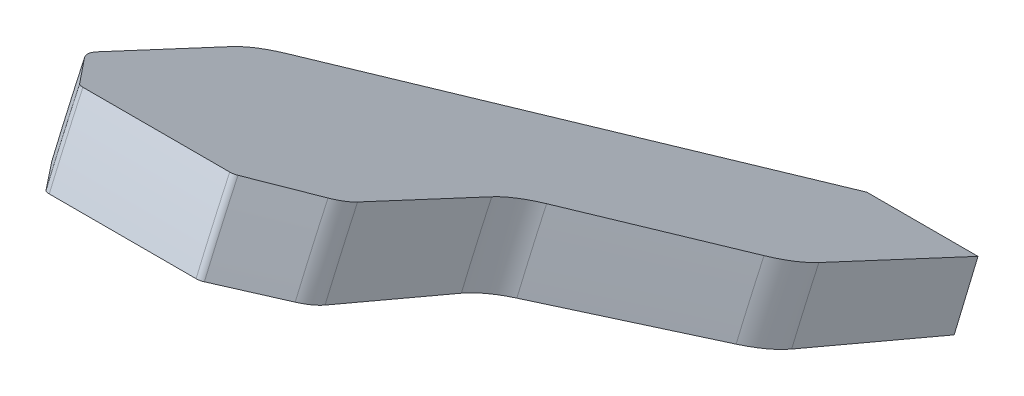
ISO-10303-21;
HEADER;
FILE_DESCRIPTION(('STEP AP214'),'2;1');
FILE_NAME('part.step','',(''),(''),'','','');
FILE_SCHEMA(('AUTOMOTIVE_DESIGN { 1 0 10303 214 1 1 1 1 }'));
ENDSEC;
DATA;
#1=APPLICATION_CONTEXT('core data for automotive mechanical design processes');
#2=APPLICATION_PROTOCOL_DEFINITION('international standard','automotive_design',2000,#1);
#3=PRODUCT_CONTEXT('',#1,'mechanical');
#4=PRODUCT('Part','Part','',(#3));
#5=PRODUCT_RELATED_PRODUCT_CATEGORY('part','',(#4));
#6=PRODUCT_DEFINITION_FORMATION('','',#4);
#7=PRODUCT_DEFINITION_CONTEXT('part definition',#1,'design');
#8=PRODUCT_DEFINITION('design','',#6,#7);
#9=PRODUCT_DEFINITION_SHAPE('','',#8);
#10=(LENGTH_UNIT() NAMED_UNIT(*) SI_UNIT(.MILLI.,.METRE.));
#11=(NAMED_UNIT(*) PLANE_ANGLE_UNIT() SI_UNIT($,.RADIAN.));
#12=(NAMED_UNIT(*) SI_UNIT($,.STERADIAN.) SOLID_ANGLE_UNIT());
#13=UNCERTAINTY_MEASURE_WITH_UNIT(LENGTH_MEASURE(1.E-05),#10,'distance_accuracy_value','');
#14=(GEOMETRIC_REPRESENTATION_CONTEXT(3) GLOBAL_UNCERTAINTY_ASSIGNED_CONTEXT((#13)) GLOBAL_UNIT_ASSIGNED_CONTEXT((#10,
#11,#12)) REPRESENTATION_CONTEXT('',''));
#15=CARTESIAN_POINT('',(0.,0.,0.));
#16=DIRECTION('',(0.,0.,1.));
#17=DIRECTION('',(1.,0.,0.));
#18=AXIS2_PLACEMENT_3D('',#15,#16,#17);
#19=CARTESIAN_POINT('',(-10.4391590238994,24.913016752476,58.6913894561276));
#20=DIRECTION('',(0.,-0.920504853452441,0.390731128489273));
#21=DIRECTION('',(0.,-0.390731128489273,-0.920504853452441));
#22=AXIS2_PLACEMENT_3D('',#19,#20,#21);
#23=PLANE('',#22);
#24=DIRECTION('',(-1.,0.,0.));
#25=VECTOR('',#24,1.);
#26=CARTESIAN_POINT('',(-4.85737883832815,24.913016752476,58.6913894561276));
#27=LINE('',#26,#25);
#28=CARTESIAN_POINT('',(-4.95260755660507,24.913016752476,58.6913894561276));
#29=VERTEX_POINT('',#28);
#30=CARTESIAN_POINT('',(-8.903798903946,24.913016752476,58.6913894561276));
#31=VERTEX_POINT('',#30);
#32=EDGE_CURVE('E53',#29,#31,#27,.T.);
#33=ORIENTED_EDGE('',*,*,#32,.T.);
#34=CARTESIAN_POINT('',(-8.903798903946,24.8348705267782,58.5072884854371));
#35=DIRECTION('',(0.,-0.920504853452441,0.390731128489273));
#36=DIRECTION('',(0.,-0.390731128489273,-0.920504853452441));
#37=AXIS2_PLACEMENT_3D('',#34,#35,#36);
#38=CIRCLE('',#37,0.2);
#39=CARTESIAN_POINT('',(-9.05905728963662,24.8841318423053,58.6233408721652));
#40=VERTEX_POINT('',#39);
#41=EDGE_CURVE('E249',#40,#31,#38,.F.);
#42=ORIENTED_EDGE('',*,*,#41,.F.);
#43=DIRECTION('',(-0.630373573223483,-0.3033214212416,-0.714580487837049));
#44=VECTOR('',#43,1.);
#45=CARTESIAN_POINT('',(-60.7741621503113,0.,0.));
#46=LINE('',#45,#44);
#47=CARTESIAN_POINT('',(-10.2044951587286,24.3329732005806,57.3248924821141));
#48=VERTEX_POINT('',#47);
#49=EDGE_CURVE('E183',#40,#48,#46,.T.);
#50=ORIENTED_EDGE('',*,*,#49,.T.);
#51=CARTESIAN_POINT('',(-9.42820323027553,24.0866666229452,56.7446305484737));
#52=DIRECTION('',(0.,-0.920504853452441,0.390731128489273));
#53=DIRECTION('',(0.,-0.390731128489273,-0.920504853452441));
#54=AXIS2_PLACEMENT_3D('',#51,#52,#53);
#55=CIRCLE('',#54,1.);
#56=CARTESIAN_POINT('',(-10.4282032302755,24.0866666229452,56.7446305484737));
#57=VERTEX_POINT('',#56);
#58=EDGE_CURVE('E256',#57,#48,#55,.F.);
#59=ORIENTED_EDGE('',*,*,#58,.F.);
#60=DIRECTION('',(0.,0.390731128489273,0.920504853452441));
#61=VECTOR('',#60,1.);
#62=CARTESIAN_POINT('',(-10.4282032302755,0.,0.));
#63=LINE('',#62,#61);
#64=CARTESIAN_POINT('',(-10.4282032302755,22.5304956136124,53.0785213945105));
#65=VERTEX_POINT('',#64);
#66=EDGE_CURVE('E262',#65,#57,#63,.T.);
#67=ORIENTED_EDGE('',*,*,#66,.F.);
#68=CARTESIAN_POINT('',(-8.42820323027553,22.5304956136124,53.0785213945105));
#69=DIRECTION('',(0.,-0.920504853452441,0.390731128489273));
#70=DIRECTION('',(0.,-0.390731128489273,-0.920504853452441));
#71=AXIS2_PLACEMENT_3D('',#68,#69,#70);
#72=CIRCLE('',#71,2.);
#73=CARTESIAN_POINT('',(-10.032799626279,22.0640224695386,51.9795795344512));
#74=VERTEX_POINT('',#73);
#75=EDGE_CURVE('E258',#74,#65,#72,.F.);
#76=ORIENTED_EDGE('',*,*,#75,.F.);
#77=DIRECTION('',(-0.596923446920273,0.313482880290125,0.738519385176738));
#78=VECTOR('',#77,1.);
#79=CARTESIAN_POINT('',(31.9807621135333,0.,0.));
#80=LINE('',#79,#78);
#81=CARTESIAN_POINT('',(-2.97148780713836,18.3556736366831,43.2432571632687));
#82=VERTEX_POINT('',#81);
#83=EDGE_CURVE('E273',#74,#82,#80,.F.);
#84=ORIENTED_EDGE('',*,*,#83,.T.);
#85=DIRECTION('',(1.,0.,0.));
#86=VECTOR('',#85,1.);
#87=CARTESIAN_POINT('',(-10.4391590238994,18.3556736366831,43.2432571632687));
#88=LINE('',#87,#86);
#89=CARTESIAN_POINT('',(0.,18.3556736366831,43.2432571632687));
#90=VERTEX_POINT('',#89);
#91=EDGE_CURVE('E11',#82,#90,#88,.T.);
#92=ORIENTED_EDGE('',*,*,#91,.T.);
#93=DIRECTION('',(0.,-0.390731128489273,-0.920504853452441));
#94=VECTOR('',#93,1.);
#95=CARTESIAN_POINT('',(0.,0.,0.));
#96=LINE('',#95,#94);
#97=CARTESIAN_POINT('',(0.,20.2124831066785,47.6176261460413));
#98=VERTEX_POINT('',#97);
#99=EDGE_CURVE('E177',#98,#90,#96,.T.);
#100=ORIENTED_EDGE('',*,*,#99,.F.);
#101=CARTESIAN_POINT('',(-2.,20.2124831066785,47.6176261460413));
#102=DIRECTION('',(0.,-0.920504853452441,0.390731128489273));
#103=DIRECTION('',(0.,-0.390731128489273,-0.920504853452441));
#104=AXIS2_PLACEMENT_3D('',#101,#102,#103);
#105=CIRCLE('',#104,2.);
#106=CARTESIAN_POINT('',(-0.395403603996536,20.6789562507522,48.7165680061006));
#107=VERTEX_POINT('',#106);
#108=EDGE_CURVE('E194',#107,#98,#105,.F.);
#109=ORIENTED_EDGE('',*,*,#108,.F.);
#110=DIRECTION('',(-0.596923446920273,0.313482880290125,0.738519385176738));
#111=VECTOR('',#110,1.);
#112=CARTESIAN_POINT('',(38.9807621135333,0.,0.));
#113=LINE('',#112,#111);
#114=CARTESIAN_POINT('',(-3.03279962627898,22.0640224695386,51.9795795344512));
#115=VERTEX_POINT('',#114);
#116=EDGE_CURVE('E182',#107,#115,#113,.T.);
#117=ORIENTED_EDGE('',*,*,#116,.T.);
#118=CARTESIAN_POINT('',(-1.42820323027553,22.5304956136124,53.0785213945106));
#119=DIRECTION('',(0.,-0.920504853452441,0.390731128489273));
#120=DIRECTION('',(0.,-0.390731128489273,-0.920504853452441));
#121=AXIS2_PLACEMENT_3D('',#118,#119,#120);
#122=CIRCLE('',#121,2.);
#123=CARTESIAN_POINT('',(-3.42820323027553,22.5304956136124,53.0785213945106));
#124=VERTEX_POINT('',#123);
#125=EDGE_CURVE('E164',#115,#124,#122,.F.);
#126=ORIENTED_EDGE('',*,*,#125,.T.);
#127=DIRECTION('',(0.,-0.390731128489273,-0.920504853452441));
#128=VECTOR('',#127,1.);
#129=CARTESIAN_POINT('',(-3.42820323027553,0.,0.));
#130=LINE('',#129,#128);
#131=CARTESIAN_POINT('',(-3.42820323027553,24.0866666229452,56.7446305484737));
#132=VERTEX_POINT('',#131);
#133=EDGE_CURVE('E172',#132,#124,#130,.T.);
#134=ORIENTED_EDGE('',*,*,#133,.F.);
#135=CARTESIAN_POINT('',(-4.42820323027554,24.0866666229452,56.7446305484737));
#136=DIRECTION('',(0.,-0.920504853452441,0.390731128489273));
#137=DIRECTION('',(0.,-0.390731128489273,-0.920504853452441));
#138=AXIS2_PLACEMENT_3D('',#135,#136,#137);
#139=CIRCLE('',#138,1.);
#140=CARTESIAN_POINT('',(-3.65191130182241,24.3329732005806,57.324892482114));
#141=VERTEX_POINT('',#140);
#142=EDGE_CURVE('E254',#141,#132,#139,.F.);
#143=ORIENTED_EDGE('',*,*,#142,.F.);
#144=DIRECTION('',(-0.630373573223483,0.3033214212416,0.714580487837049));
#145=VECTOR('',#144,1.);
#146=CARTESIAN_POINT('',(46.9177556897602,0.,0.));
#147=LINE('',#146,#145);
#148=CARTESIAN_POINT('',(-4.79734917091444,24.8841318423053,58.6233408721652));
#149=VERTEX_POINT('',#148);
#150=EDGE_CURVE('E178',#149,#141,#147,.F.);
#151=ORIENTED_EDGE('',*,*,#150,.F.);
#152=CARTESIAN_POINT('',(-4.95260755660507,24.8348705267782,58.5072884854371));
#153=DIRECTION('',(0.,-0.920504853452441,0.390731128489273));
#154=DIRECTION('',(0.,-0.390731128489273,-0.920504853452441));
#155=AXIS2_PLACEMENT_3D('',#152,#153,#154);
#156=CIRCLE('',#155,0.2);
#157=EDGE_CURVE('E252',#29,#149,#156,.F.);
#158=ORIENTED_EDGE('',*,*,#157,.F.);
#159=EDGE_LOOP('',(#33,#42,#50,#59,#67,#76,#84,#92,#100,#109,#117,#126,#134,#143,#151,#158));
#160=FACE_BOUND('',#159,.T.);
#161=ADVANCED_FACE('F44',(#160),#23,.T.);
#162=CARTESIAN_POINT('',(-10.4391590238994,18.3556736366831,43.2432571632687));
#163=DIRECTION('',(0.,-0.390731128489274,-0.92050485345244));
#164=DIRECTION('',(0.,0.92050485345244,-0.390731128489274));
#165=AXIS2_PLACEMENT_3D('',#162,#163,#164);
#166=PLANE('',#165);
#167=ORIENTED_EDGE('',*,*,#91,.F.);
#168=CARTESIAN_POINT('',(-2.97148780751219,18.3554736366831,43.2433420582319));
#169=CARTESIAN_POINT('',(-2.97148827755682,18.6072640630063,43.136463363295));
#170=CARTESIAN_POINT('',(-2.97326439481779,18.8590332624075,43.029593678652));
#171=CARTESIAN_POINT('',(-2.98036792368115,19.3625292008967,42.8158723326995));
#172=CARTESIAN_POINT('',(-2.98569533519229,19.6142559399859,42.7090206713896));
#173=CARTESIAN_POINT('',(-2.9927983938285,19.865961452154,42.602178020373));
#174=B_SPLINE_CURVE_WITH_KNOTS('',3,(#168,#169,#170,#171,#172,#173),.UNSPECIFIED.,.F.,.F.,(4,2,
4),(0.,0.820553547733461,1.64110707438179),.UNSPECIFIED.);
#175=CARTESIAN_POINT('',(-2.9927927518085,19.865761452154,42.6022629153363));
#176=VERTEX_POINT('',#175);
#177=EDGE_CURVE('E186',#82,#176,#174,.T.);
#178=ORIENTED_EDGE('',*,*,#177,.T.);
#179=DIRECTION('',(-1.,0.,0.));
#180=VECTOR('',#179,1.);
#181=CARTESIAN_POINT('',(0.,19.865761452154,42.6022629153363));
#182=LINE('',#181,#180);
#183=CARTESIAN_POINT('',(0.,19.865761452154,42.6022629153363));
#184=VERTEX_POINT('',#183);
#185=EDGE_CURVE('E260',#184,#176,#182,.T.);
#186=ORIENTED_EDGE('',*,*,#185,.F.);
#187=DIRECTION('',(0.,0.92050485345244,-0.390731128489274));
#188=VECTOR('',#187,1.);
#189=CARTESIAN_POINT('',(0.,18.3556736366831,43.2432571632686));
#190=LINE('',#189,#188);
#191=EDGE_CURVE('E265',#90,#184,#190,.T.);
#192=ORIENTED_EDGE('',*,*,#191,.F.);
#193=EDGE_LOOP('',(#167,#178,#186,#192));
#194=FACE_BOUND('',#193,.T.);
#195=ADVANCED_FACE('F286',(#194),#166,.T.);
#196=CARTESIAN_POINT('',(-3.42820323027553,0.,0.));
#197=DIRECTION('',(1.,0.,0.));
#198=DIRECTION('',(0.,0.,-1.));
#199=AXIS2_PLACEMENT_3D('',#196,#197,#198);
#200=PLANE('',#199);
#201=CARTESIAN_POINT('',(-3.42820323027553,0.,0.));
#202=DIRECTION('',(1.,0.,0.));
#203=DIRECTION('',(0.,0.,-1.));
#204=AXIS2_PLACEMENT_3D('',#201,#202,#203);
#205=CIRCLE('',#204,61.6451182583639);
#206=CARTESIAN_POINT('',(-3.42820323027553,26.0523527231497,55.8694507103504));
#207=VERTEX_POINT('',#206);
#208=EDGE_CURVE('E175',#207,#132,#205,.T.);
#209=ORIENTED_EDGE('',*,*,#208,.T.);
#210=ORIENTED_EDGE('',*,*,#133,.T.);
#211=CARTESIAN_POINT('',(-3.42820323027553,0.,0.));
#212=DIRECTION('',(1.,0.,0.));
#213=DIRECTION('',(0.,0.,-1.));
#214=AXIS2_PLACEMENT_3D('',#211,#212,#213);
#215=CIRCLE('',#214,57.6624025342555);
#216=CARTESIAN_POINT('',(-3.42820323027553,24.3691843268196,52.2598844360376));
#217=VERTEX_POINT('',#216);
#218=EDGE_CURVE('E69',#124,#217,#215,.F.);
#219=ORIENTED_EDGE('',*,*,#218,.T.);
#220=DIRECTION('',(0.,-0.4226182617407,-0.90630778703665));
#221=VECTOR('',#220,1.);
#222=CARTESIAN_POINT('',(-3.42820323027553,0.,0.));
#223=LINE('',#222,#221);
#224=EDGE_CURVE('E239',#207,#217,#223,.T.);
#225=ORIENTED_EDGE('',*,*,#224,.F.);
#226=EDGE_LOOP('',(#209,#210,#219,#225));
#227=FACE_BOUND('',#226,.T.);
#228=ADVANCED_FACE('F173',(#227),#200,.T.);
#229=CARTESIAN_POINT('',(-4.85737883832815,0.,0.));
#230=DIRECTION('',(-1.,0.,0.));
#231=DIRECTION('',(0.,0.,1.));
#232=AXIS2_PLACEMENT_3D('',#229,#230,#231);
#233=CONICAL_SURFACE('',#232,63.76,0.88876198144473);
#234=CARTESIAN_POINT('',(-4.79734917091444,0.,0.));
#235=DIRECTION('',(-1.,0.,0.));
#236=DIRECTION('',(0.,0.,1.));
#237=AXIS2_PLACEMENT_3D('',#234,#235,#236);
#238=CIRCLE('',#237,63.6860747146447);
#239=CARTESIAN_POINT('',(-4.79734917091446,26.9148981929915,57.7191854396804));
#240=VERTEX_POINT('',#239);
#241=EDGE_CURVE('E199',#240,#149,#238,.F.);
#242=ORIENTED_EDGE('',*,*,#241,.T.);
#243=ORIENTED_EDGE('',*,*,#150,.T.);
#244=CARTESIAN_POINT('',(-3.65191130182241,0.,0.));
#245=DIRECTION('',(1.,0.,0.));
#246=DIRECTION('',(0.,0.,-1.));
#247=AXIS2_PLACEMENT_3D('',#244,#245,#246);
#248=CIRCLE('',#247,62.2754918315874);
#249=CARTESIAN_POINT('',(-3.65191130182242,26.3187601069127,56.440763188505));
#250=VERTEX_POINT('',#249);
#251=EDGE_CURVE('E210',#141,#250,#248,.F.);
#252=ORIENTED_EDGE('',*,*,#251,.T.);
#253=DIRECTION('',(0.630373573223483,-0.328075145406192,-0.703559419770757));
#254=VECTOR('',#253,1.);
#255=CARTESIAN_POINT('',(28.2740076150835,9.7030564419735,20.808271689907));
#256=LINE('',#255,#254);
#257=EDGE_CURVE('E241',#240,#250,#256,.T.);
#258=ORIENTED_EDGE('',*,*,#257,.F.);
#259=EDGE_LOOP('',(#242,#243,#252,#258));
#260=FACE_BOUND('',#259,.T.);
#261=ADVANCED_FACE('F307',(#260),#233,.T.);
#262=CARTESIAN_POINT('',(0.,0.,0.));
#263=DIRECTION('',(0.,0.90630778703665,-0.4226182617407));
#264=DIRECTION('',(0.,0.4226182617407,0.90630778703665));
#265=AXIS2_PLACEMENT_3D('',#262,#263,#264);
#266=PLANE('',#265);
#267=DIRECTION('',(0.,-0.4226182617407,-0.90630778703665));
#268=VECTOR('',#267,1.);
#269=CARTESIAN_POINT('',(0.,0.,0.));
#270=LINE('',#269,#268);
#271=CARTESIAN_POINT('',(0.,21.8620013947577,46.8832132872474));
#272=VERTEX_POINT('',#271);
#273=EDGE_CURVE('E48',#272,#184,#270,.T.);
#274=ORIENTED_EDGE('',*,*,#273,.T.);
#275=ORIENTED_EDGE('',*,*,#185,.T.);
#276=DIRECTION('',(0.596923446920273,-0.339065869837187,-0.727129104374438));
#277=VECTOR('',#276,1.);
#278=CARTESIAN_POINT('',(20.585453663635,6.47279008985531,13.8809431427004));
#279=LINE('',#278,#277);
#280=CARTESIAN_POINT('',(-10.032799626279,23.8646428277602,51.1778916996204));
#281=VERTEX_POINT('',#280);
#282=EDGE_CURVE('E224',#281,#176,#279,.T.);
#283=ORIENTED_EDGE('',*,*,#282,.F.);
#284=CARTESIAN_POINT('',(-8.42820323027553,24.3691843268196,52.2598844360376));
#285=DIRECTION('',(0.,0.90630778703665,-0.4226182617407));
#286=DIRECTION('',(0.,0.4226182617407,0.90630778703665));
#287=AXIS2_PLACEMENT_3D('',#284,#285,#286);
#288=CIRCLE('',#287,2.);
#289=CARTESIAN_POINT('',(-10.4282032302755,24.3691843268196,52.2598844360376));
#290=VERTEX_POINT('',#289);
#291=EDGE_CURVE('E222',#281,#290,#288,.T.);
#292=ORIENTED_EDGE('',*,*,#291,.T.);
#293=DIRECTION('',(0.,0.4226182617407,0.90630778703665));
#294=VECTOR('',#293,1.);
#295=CARTESIAN_POINT('',(-10.4282032302755,0.,0.));
#296=LINE('',#295,#294);
#297=CARTESIAN_POINT('',(-10.4282032302755,26.0523527231497,55.8694507103504));
#298=VERTEX_POINT('',#297);
#299=EDGE_CURVE('E225',#290,#298,#296,.T.);
#300=ORIENTED_EDGE('',*,*,#299,.T.);
#301=CARTESIAN_POINT('',(-9.42820323027553,26.0523527231497,55.8694507103504));
#302=DIRECTION('',(0.,0.90630778703665,-0.4226182617407));
#303=DIRECTION('',(0.,0.4226182617407,0.90630778703665));
#304=AXIS2_PLACEMENT_3D('',#301,#302,#303);
#305=CIRCLE('',#304,1.);
#306=CARTESIAN_POINT('',(-10.2044951587286,26.3187601069127,56.440763188505));
#307=VERTEX_POINT('',#306);
#308=EDGE_CURVE('E215',#298,#307,#305,.T.);
#309=ORIENTED_EDGE('',*,*,#308,.T.);
#310=DIRECTION('',(-0.630373573223483,-0.328075145406192,-0.703559419770757));
#311=VECTOR('',#310,1.);
#312=CARTESIAN_POINT('',(-36.6242821758255,12.5686984999332,26.9536609149047));
#313=LINE('',#312,#311);
#314=CARTESIAN_POINT('',(-9.0590572896366,26.9148981929915,57.7191854396804));
#315=VERTEX_POINT('',#314);
#316=EDGE_CURVE('E223',#315,#307,#313,.T.);
#317=ORIENTED_EDGE('',*,*,#316,.F.);
#318=CARTESIAN_POINT('',(-8.903798903946,26.8616167162389,57.6049229440494));
#319=DIRECTION('',(0.,0.90630778703665,-0.4226182617407));
#320=DIRECTION('',(0.,0.4226182617407,0.90630778703665));
#321=AXIS2_PLACEMENT_3D('',#318,#319,#320);
#322=CIRCLE('',#321,0.2);
#323=CARTESIAN_POINT('',(-8.903798903946,26.9461403685871,57.7861845014568));
#324=VERTEX_POINT('',#323);
#325=EDGE_CURVE('E206',#315,#324,#322,.T.);
#326=ORIENTED_EDGE('',*,*,#325,.T.);
#327=DIRECTION('',(1.,0.,0.));
#328=VECTOR('',#327,1.);
#329=CARTESIAN_POINT('',(8.04407046023862E-13,26.946140368587,57.7861845014567));
#330=LINE('',#329,#328);
#331=CARTESIAN_POINT('',(-4.95260755660507,26.946140368587,57.7861845014568));
#332=VERTEX_POINT('',#331);
#333=EDGE_CURVE('E244',#324,#332,#330,.T.);
#334=ORIENTED_EDGE('',*,*,#333,.T.);
#335=CARTESIAN_POINT('',(-4.95260755660507,26.8616167162389,57.6049229440494));
#336=DIRECTION('',(0.,0.90630778703665,-0.4226182617407));
#337=DIRECTION('',(0.,0.4226182617407,0.90630778703665));
#338=AXIS2_PLACEMENT_3D('',#335,#336,#337);
#339=CIRCLE('',#338,0.2);
#340=EDGE_CURVE('E202',#332,#240,#339,.T.);
#341=ORIENTED_EDGE('',*,*,#340,.T.);
#342=ORIENTED_EDGE('',*,*,#257,.T.);
#343=CARTESIAN_POINT('',(-4.42820323027554,26.0523527231497,55.8694507103504));
#344=DIRECTION('',(0.,0.90630778703665,-0.4226182617407));
#345=DIRECTION('',(0.,0.4226182617407,0.90630778703665));
#346=AXIS2_PLACEMENT_3D('',#343,#344,#345);
#347=CIRCLE('',#346,1.);
#348=EDGE_CURVE('E218',#250,#207,#347,.T.);
#349=ORIENTED_EDGE('',*,*,#348,.T.);
#350=ORIENTED_EDGE('',*,*,#224,.T.);
#351=CARTESIAN_POINT('',(-1.42820323027553,24.3691843268196,52.2598844360376));
#352=DIRECTION('',(0.,0.90630778703665,-0.4226182617407));
#353=DIRECTION('',(0.,0.4226182617407,0.90630778703665));
#354=AXIS2_PLACEMENT_3D('',#351,#352,#353);
#355=CIRCLE('',#354,2.);
#356=CARTESIAN_POINT('',(-3.03279962627898,23.8646428277602,51.1778916996204));
#357=VERTEX_POINT('',#356);
#358=EDGE_CURVE('E166',#217,#357,#355,.F.);
#359=ORIENTED_EDGE('',*,*,#358,.T.);
#360=DIRECTION('',(-0.596923446920273,0.339065869837187,0.727129104374438));
#361=VECTOR('',#360,1.);
#362=CARTESIAN_POINT('',(25.0912304532527,7.88956466414895,16.919226022075));
#363=LINE('',#362,#361);
#364=CARTESIAN_POINT('',(-0.39540360399655,22.3665428938171,47.9652060236646));
#365=VERTEX_POINT('',#364);
#366=EDGE_CURVE('E229',#365,#357,#363,.T.);
#367=ORIENTED_EDGE('',*,*,#366,.F.);
#368=CARTESIAN_POINT('',(-2.,21.8620013947577,46.8832132872474));
#369=DIRECTION('',(0.,0.90630778703665,-0.4226182617407));
#370=DIRECTION('',(0.,0.4226182617407,0.90630778703665));
#371=AXIS2_PLACEMENT_3D('',#368,#369,#370);
#372=CIRCLE('',#371,2.);
#373=EDGE_CURVE('E193',#365,#272,#372,.T.);
#374=ORIENTED_EDGE('',*,*,#373,.T.);
#375=EDGE_LOOP('',(#274,#275,#283,#292,#300,#309,#317,#326,#334,#341,#342,#349,#350,#359,#367,#374));
#376=FACE_BOUND('',#375,.T.);
#377=ADVANCED_FACE('F46',(#376),#266,.T.);
#378=CARTESIAN_POINT('',(0.,0.,0.));
#379=DIRECTION('',(1.,0.,0.));
#380=DIRECTION('',(0.,0.,-1.));
#381=AXIS2_PLACEMENT_3D('',#378,#379,#380);
#382=PLANE('',#381);
#383=CARTESIAN_POINT('',(0.,0.,0.));
#384=DIRECTION('',(1.,0.,0.));
#385=DIRECTION('',(0.,0.,-1.));
#386=AXIS2_PLACEMENT_3D('',#383,#384,#385);
#387=CIRCLE('',#386,51.7299023111577);
#388=EDGE_CURVE('E190',#272,#98,#387,.T.);
#389=ORIENTED_EDGE('',*,*,#388,.T.);
#390=ORIENTED_EDGE('',*,*,#99,.T.);
#391=ORIENTED_EDGE('',*,*,#191,.T.);
#392=ORIENTED_EDGE('',*,*,#273,.F.);
#393=EDGE_LOOP('',(#389,#390,#391,#392));
#394=FACE_BOUND('',#393,.T.);
#395=ADVANCED_FACE('F296',(#394),#382,.T.);
#396=CARTESIAN_POINT('',(0.,0.,0.));
#397=DIRECTION('',(-1.,0.,0.));
#398=DIRECTION('',(0.,0.,1.));
#399=AXIS2_PLACEMENT_3D('',#396,#397,#398);
#400=CONICAL_SURFACE('',#399,52.3923048454132,0.931135388704866);
#401=ORIENTED_EDGE('',*,*,#116,.F.);
#402=CARTESIAN_POINT('',(-0.395403603996536,0.,0.));
#403=DIRECTION('',(-1.,0.,0.));
#404=DIRECTION('',(0.,0.,1.));
#405=AXIS2_PLACEMENT_3D('',#402,#403,#404);
#406=CIRCLE('',#405,52.9237492049983);
#407=EDGE_CURVE('E195',#107,#365,#406,.T.);
#408=ORIENTED_EDGE('',*,*,#407,.T.);
#409=ORIENTED_EDGE('',*,*,#366,.T.);
#410=CARTESIAN_POINT('',(-3.03279962627898,0.,0.));
#411=DIRECTION('',(1.,0.,0.));
#412=DIRECTION('',(0.,0.,-1.));
#413=AXIS2_PLACEMENT_3D('',#410,#411,#412);
#414=CIRCLE('',#413,56.468555640415);
#415=EDGE_CURVE('E168',#357,#115,#414,.T.);
#416=ORIENTED_EDGE('',*,*,#415,.T.);
#417=EDGE_LOOP('',(#401,#408,#409,#416));
#418=FACE_BOUND('',#417,.T.);
#419=ADVANCED_FACE('F293',(#418),#400,.T.);
#420=CARTESIAN_POINT('',(-2.,0.,0.));
#421=DIRECTION('',(1.,0.,0.));
#422=DIRECTION('',(0.,0.,-1.));
#423=AXIS2_PLACEMENT_3D('',#420,#421,#422);
#424=TOROIDAL_SURFACE('',#423,51.7299023111577,2.);
#425=ORIENTED_EDGE('',*,*,#407,.F.);
#426=ORIENTED_EDGE('',*,*,#108,.T.);
#427=ORIENTED_EDGE('',*,*,#388,.F.);
#428=ORIENTED_EDGE('',*,*,#373,.F.);
#429=EDGE_LOOP('',(#425,#426,#427,#428));
#430=FACE_BOUND('',#429,.T.);
#431=ADVANCED_FACE('F295',(#430),#424,.T.);
#432=CARTESIAN_POINT('',(0.,0.,0.));
#433=DIRECTION('',(-1.,0.,0.));
#434=DIRECTION('',(0.,0.,1.));
#435=AXIS2_PLACEMENT_3D('',#432,#433,#434);
#436=CYLINDRICAL_SURFACE('',#435,63.76);
#437=ORIENTED_EDGE('',*,*,#32,.F.);
#438=CARTESIAN_POINT('',(-4.95260755660507,0.,0.));
#439=DIRECTION('',(1.,0.,0.));
#440=DIRECTION('',(0.,0.,-1.));
#441=AXIS2_PLACEMENT_3D('',#438,#439,#440);
#442=CIRCLE('',#441,63.76);
#443=EDGE_CURVE('E203',#29,#332,#442,.F.);
#444=ORIENTED_EDGE('',*,*,#443,.T.);
#445=ORIENTED_EDGE('',*,*,#333,.F.);
#446=CARTESIAN_POINT('',(-8.903798903946,0.,0.));
#447=DIRECTION('',(1.,0.,0.));
#448=DIRECTION('',(0.,0.,-1.));
#449=AXIS2_PLACEMENT_3D('',#446,#447,#448);
#450=CIRCLE('',#449,63.76);
#451=EDGE_CURVE('E205',#324,#31,#450,.T.);
#452=ORIENTED_EDGE('',*,*,#451,.T.);
#453=EDGE_LOOP('',(#437,#444,#445,#452));
#454=FACE_BOUND('',#453,.T.);
#455=ADVANCED_FACE('F302',(#454),#436,.T.);
#456=CARTESIAN_POINT('',(-8.99902762222291,0.,0.));
#457=DIRECTION('',(1.,0.,0.));
#458=DIRECTION('',(0.,0.,-1.));
#459=AXIS2_PLACEMENT_3D('',#456,#457,#458);
#460=CONICAL_SURFACE('',#459,63.76,0.88876198144473);
#461=ORIENTED_EDGE('',*,*,#49,.F.);
#462=CARTESIAN_POINT('',(-9.05905728963662,0.,0.));
#463=DIRECTION('',(-1.,0.,0.));
#464=DIRECTION('',(0.,0.,1.));
#465=AXIS2_PLACEMENT_3D('',#462,#463,#464);
#466=CIRCLE('',#465,63.6860747146447);
#467=EDGE_CURVE('E197',#40,#315,#466,.T.);
#468=ORIENTED_EDGE('',*,*,#467,.T.);
#469=ORIENTED_EDGE('',*,*,#316,.T.);
#470=CARTESIAN_POINT('',(-10.2044951587286,0.,0.));
#471=DIRECTION('',(1.,0.,0.));
#472=DIRECTION('',(0.,0.,-1.));
#473=AXIS2_PLACEMENT_3D('',#470,#471,#472);
#474=CIRCLE('',#473,62.2754918315874);
#475=EDGE_CURVE('E212',#307,#48,#474,.T.);
#476=ORIENTED_EDGE('',*,*,#475,.T.);
#477=EDGE_LOOP('',(#461,#468,#469,#476));
#478=FACE_BOUND('',#477,.T.);
#479=ADVANCED_FACE('F318',(#478),#460,.T.);
#480=CARTESIAN_POINT('',(-8.903798903946,0.,0.));
#481=DIRECTION('',(1.,0.,0.));
#482=DIRECTION('',(0.,0.,-1.));
#483=AXIS2_PLACEMENT_3D('',#480,#481,#482);
#484=TOROIDAL_SURFACE('',#483,63.56,0.2);
#485=ORIENTED_EDGE('',*,*,#467,.F.);
#486=ORIENTED_EDGE('',*,*,#41,.T.);
#487=ORIENTED_EDGE('',*,*,#451,.F.);
#488=ORIENTED_EDGE('',*,*,#325,.F.);
#489=EDGE_LOOP('',(#485,#486,#487,#488));
#490=FACE_BOUND('',#489,.T.);
#491=ADVANCED_FACE('F322',(#490),#484,.T.);
#492=CARTESIAN_POINT('',(-4.95260755660507,0.,0.));
#493=DIRECTION('',(1.,0.,0.));
#494=DIRECTION('',(0.,0.,-1.));
#495=AXIS2_PLACEMENT_3D('',#492,#493,#494);
#496=TOROIDAL_SURFACE('',#495,63.56,0.2);
#497=ORIENTED_EDGE('',*,*,#443,.F.);
#498=ORIENTED_EDGE('',*,*,#157,.T.);
#499=ORIENTED_EDGE('',*,*,#241,.F.);
#500=ORIENTED_EDGE('',*,*,#340,.F.);
#501=EDGE_LOOP('',(#497,#498,#499,#500));
#502=FACE_BOUND('',#501,.T.);
#503=ADVANCED_FACE('F326',(#502),#496,.T.);
#504=CARTESIAN_POINT('',(-4.42820323027554,0.,0.));
#505=DIRECTION('',(1.,0.,0.));
#506=DIRECTION('',(0.,0.,-1.));
#507=AXIS2_PLACEMENT_3D('',#504,#505,#506);
#508=TOROIDAL_SURFACE('',#507,61.6451182583639,1.);
#509=ORIENTED_EDGE('',*,*,#251,.F.);
#510=ORIENTED_EDGE('',*,*,#142,.T.);
#511=ORIENTED_EDGE('',*,*,#208,.F.);
#512=ORIENTED_EDGE('',*,*,#348,.F.);
#513=EDGE_LOOP('',(#509,#510,#511,#512));
#514=FACE_BOUND('',#513,.T.);
#515=ADVANCED_FACE('F330',(#514),#508,.T.);
#516=CARTESIAN_POINT('',(-10.4282032302755,0.,0.));
#517=DIRECTION('',(-1.,0.,0.));
#518=DIRECTION('',(0.,0.,1.));
#519=AXIS2_PLACEMENT_3D('',#516,#517,#518);
#520=PLANE('',#519);
#521=CARTESIAN_POINT('',(-10.4282032302755,0.,0.));
#522=DIRECTION('',(-1.,0.,0.));
#523=DIRECTION('',(0.,0.,1.));
#524=AXIS2_PLACEMENT_3D('',#521,#522,#523);
#525=CIRCLE('',#524,57.6624025342555);
#526=EDGE_CURVE('E167',#290,#65,#525,.F.);
#527=ORIENTED_EDGE('',*,*,#526,.T.);
#528=ORIENTED_EDGE('',*,*,#66,.T.);
#529=CARTESIAN_POINT('',(-10.4282032302755,0.,0.));
#530=DIRECTION('',(-1.,0.,0.));
#531=DIRECTION('',(0.,0.,1.));
#532=AXIS2_PLACEMENT_3D('',#529,#530,#531);
#533=CIRCLE('',#532,61.6451182583639);
#534=EDGE_CURVE('E216',#57,#298,#533,.T.);
#535=ORIENTED_EDGE('',*,*,#534,.T.);
#536=ORIENTED_EDGE('',*,*,#299,.F.);
#537=EDGE_LOOP('',(#527,#528,#535,#536));
#538=FACE_BOUND('',#537,.T.);
#539=ADVANCED_FACE('F334',(#538),#520,.T.);
#540=CARTESIAN_POINT('',(-9.42820323027553,0.,0.));
#541=DIRECTION('',(-1.,0.,0.));
#542=DIRECTION('',(0.,0.,1.));
#543=AXIS2_PLACEMENT_3D('',#540,#541,#542);
#544=TOROIDAL_SURFACE('',#543,61.6451182583639,1.);
#545=ORIENTED_EDGE('',*,*,#534,.F.);
#546=ORIENTED_EDGE('',*,*,#58,.T.);
#547=ORIENTED_EDGE('',*,*,#475,.F.);
#548=ORIENTED_EDGE('',*,*,#308,.F.);
#549=EDGE_LOOP('',(#545,#546,#547,#548));
#550=FACE_BOUND('',#549,.T.);
#551=ADVANCED_FACE('F338',(#550),#544,.T.);
#552=CARTESIAN_POINT('',(-1.42820323027553,0.,0.));
#553=DIRECTION('',(1.,0.,0.));
#554=DIRECTION('',(0.,0.,-1.));
#555=AXIS2_PLACEMENT_3D('',#552,#553,#554);
#556=TOROIDAL_SURFACE('',#555,57.6624025342555,2.);
#557=ORIENTED_EDGE('',*,*,#125,.F.);
#558=ORIENTED_EDGE('',*,*,#415,.F.);
#559=ORIENTED_EDGE('',*,*,#358,.F.);
#560=ORIENTED_EDGE('',*,*,#218,.F.);
#561=EDGE_LOOP('',(#557,#558,#559,#560));
#562=FACE_BOUND('',#561,.T.);
#563=ADVANCED_FACE('F161',(#562),#556,.F.);
#564=CARTESIAN_POINT('',(-10.4282032302755,0.,0.));
#565=DIRECTION('',(-1.,0.,0.));
#566=DIRECTION('',(0.,0.,1.));
#567=AXIS2_PLACEMENT_3D('',#564,#565,#566);
#568=CONICAL_SURFACE('',#567,57.,0.931135388704866);
#569=ORIENTED_EDGE('',*,*,#83,.F.);
#570=CARTESIAN_POINT('',(-10.032799626279,0.,0.));
#571=DIRECTION('',(-1.,0.,0.));
#572=DIRECTION('',(0.,0.,1.));
#573=AXIS2_PLACEMENT_3D('',#570,#571,#572);
#574=CIRCLE('',#573,56.468555640415);
#575=EDGE_CURVE('E61',#74,#281,#574,.T.);
#576=ORIENTED_EDGE('',*,*,#575,.T.);
#577=ORIENTED_EDGE('',*,*,#282,.T.);
#578=ORIENTED_EDGE('',*,*,#177,.F.);
#579=EDGE_LOOP('',(#569,#576,#577,#578));
#580=FACE_BOUND('',#579,.T.);
#581=ADVANCED_FACE('F282',(#580),#568,.F.);
#582=CARTESIAN_POINT('',(-8.42820323027553,0.,0.));
#583=DIRECTION('',(-1.,0.,0.));
#584=DIRECTION('',(0.,0.,1.));
#585=AXIS2_PLACEMENT_3D('',#582,#583,#584);
#586=TOROIDAL_SURFACE('',#585,57.6624025342555,2.);
#587=ORIENTED_EDGE('',*,*,#575,.F.);
#588=ORIENTED_EDGE('',*,*,#75,.T.);
#589=ORIENTED_EDGE('',*,*,#526,.F.);
#590=ORIENTED_EDGE('',*,*,#291,.F.);
#591=EDGE_LOOP('',(#587,#588,#589,#590));
#592=FACE_BOUND('',#591,.T.);
#593=ADVANCED_FACE('F292',(#592),#586,.T.);
#594=CLOSED_SHELL('',(#161,#195,#228,#261,#377,#395,#419,#431,#455,#479,#491,#503,#515,#539,
#551,#563,#581,#593));
#595=MANIFOLD_SOLID_BREP('B2',#594);
#596=ADVANCED_BREP_SHAPE_REPRESENTATION('',(#18,#595),#14);
#597=SHAPE_DEFINITION_REPRESENTATION(#9,#596);
ENDSEC;
END-ISO-10303-21;
